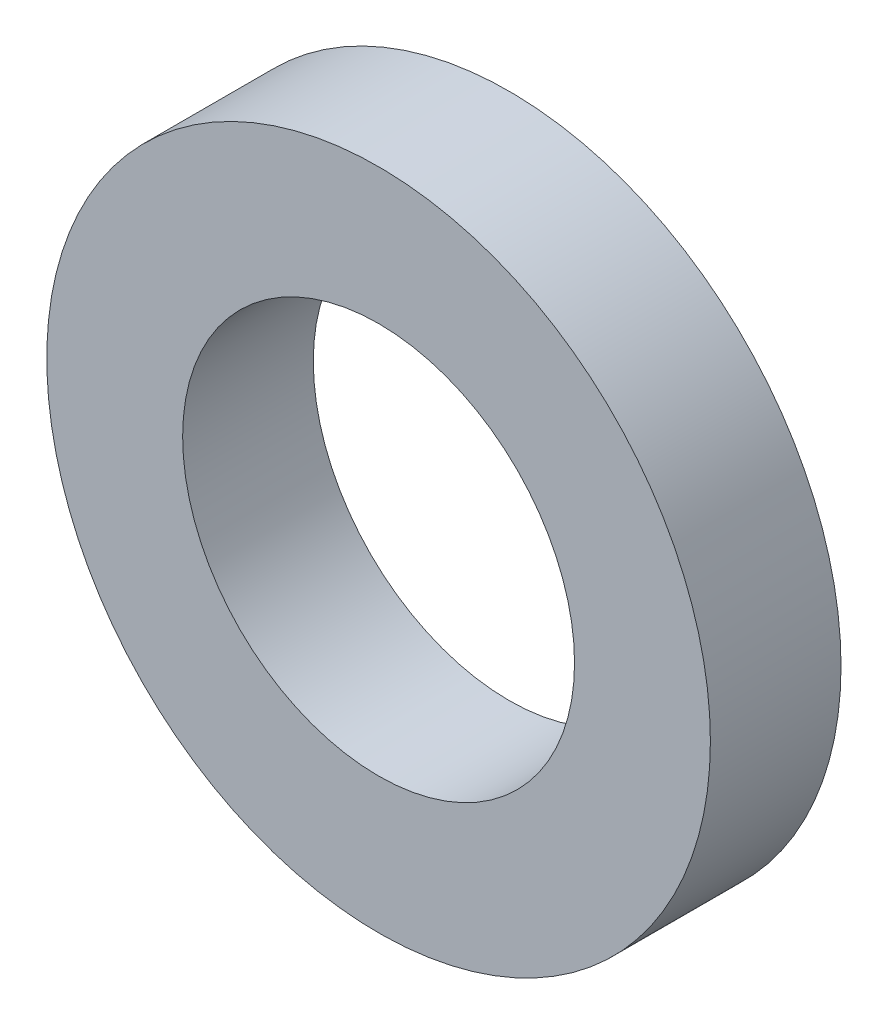
ISO-10303-21;
HEADER;
FILE_DESCRIPTION(('STEP AP214'),'2;1');
FILE_NAME('part.step','',(''),(''),'','','');
FILE_SCHEMA(('AUTOMOTIVE_DESIGN { 1 0 10303 214 1 1 1 1 }'));
ENDSEC;
DATA;
#1=APPLICATION_CONTEXT('core data for automotive mechanical design processes');
#2=APPLICATION_PROTOCOL_DEFINITION('international standard','automotive_design',2000,#1);
#3=PRODUCT_CONTEXT('',#1,'mechanical');
#4=PRODUCT('Part','Part','',(#3));
#5=PRODUCT_RELATED_PRODUCT_CATEGORY('part','',(#4));
#6=PRODUCT_DEFINITION_FORMATION('','',#4);
#7=PRODUCT_DEFINITION_CONTEXT('part definition',#1,'design');
#8=PRODUCT_DEFINITION('design','',#6,#7);
#9=PRODUCT_DEFINITION_SHAPE('','',#8);
#10=(LENGTH_UNIT() NAMED_UNIT(*) SI_UNIT(.MILLI.,.METRE.));
#11=(NAMED_UNIT(*) PLANE_ANGLE_UNIT() SI_UNIT($,.RADIAN.));
#12=(NAMED_UNIT(*) SI_UNIT($,.STERADIAN.) SOLID_ANGLE_UNIT());
#13=UNCERTAINTY_MEASURE_WITH_UNIT(LENGTH_MEASURE(1.E-05),#10,'distance_accuracy_value','');
#14=(GEOMETRIC_REPRESENTATION_CONTEXT(3) GLOBAL_UNCERTAINTY_ASSIGNED_CONTEXT((#13)) GLOBAL_UNIT_ASSIGNED_CONTEXT((#10,
#11,#12)) REPRESENTATION_CONTEXT('',''));
#15=CARTESIAN_POINT('',(0.,0.,0.));
#16=DIRECTION('',(0.,0.,1.));
#17=DIRECTION('',(1.,0.,0.));
#18=AXIS2_PLACEMENT_3D('',#15,#16,#17);
#19=CARTESIAN_POINT('',(0.,0.,0.5));
#20=DIRECTION('',(0.,0.,1.));
#21=DIRECTION('',(1.,0.,0.));
#22=AXIS2_PLACEMENT_3D('',#19,#20,#21);
#23=PLANE('',#22);
#24=CARTESIAN_POINT('',(0.,0.,0.5));
#25=DIRECTION('',(0.,0.,1.));
#26=DIRECTION('',(1.,0.,0.));
#27=AXIS2_PLACEMENT_3D('',#24,#25,#26);
#28=CIRCLE('',#27,2.54);
#29=CARTESIAN_POINT('',(2.54,0.,0.5));
#30=VERTEX_POINT('',#29);
#31=EDGE_CURVE('E10',#30,#30,#28,.T.);
#32=ORIENTED_EDGE('',*,*,#31,.T.);
#33=EDGE_LOOP('',(#32));
#34=FACE_BOUND('',#33,.T.);
#35=CARTESIAN_POINT('',(0.,0.,0.5));
#36=DIRECTION('',(0.,0.,1.));
#37=DIRECTION('',(1.,0.,0.));
#38=AXIS2_PLACEMENT_3D('',#35,#36,#37);
#39=CIRCLE('',#38,1.5);
#40=CARTESIAN_POINT('',(1.5,0.,0.5));
#41=VERTEX_POINT('',#40);
#42=EDGE_CURVE('E43',#41,#41,#39,.T.);
#43=ORIENTED_EDGE('',*,*,#42,.F.);
#44=EDGE_LOOP('',(#43));
#45=FACE_BOUND('',#44,.T.);
#46=ADVANCED_FACE('F32',(#34,#45),#23,.T.);
#47=CARTESIAN_POINT('',(0.,0.,-0.5));
#48=DIRECTION('',(0.,0.,1.));
#49=DIRECTION('',(1.,0.,0.));
#50=AXIS2_PLACEMENT_3D('',#47,#48,#49);
#51=PLANE('',#50);
#52=CARTESIAN_POINT('',(0.,0.,-0.5));
#53=DIRECTION('',(0.,0.,1.));
#54=DIRECTION('',(1.,0.,0.));
#55=AXIS2_PLACEMENT_3D('',#52,#53,#54);
#56=CIRCLE('',#55,2.54);
#57=CARTESIAN_POINT('',(2.54,0.,-0.5));
#58=VERTEX_POINT('',#57);
#59=EDGE_CURVE('E36',#58,#58,#56,.T.);
#60=ORIENTED_EDGE('',*,*,#59,.F.);
#61=EDGE_LOOP('',(#60));
#62=FACE_BOUND('',#61,.T.);
#63=CARTESIAN_POINT('',(0.,0.,-0.5));
#64=DIRECTION('',(0.,0.,1.));
#65=DIRECTION('',(1.,0.,0.));
#66=AXIS2_PLACEMENT_3D('',#63,#64,#65);
#67=CIRCLE('',#66,1.5);
#68=CARTESIAN_POINT('',(1.5,0.,-0.5));
#69=VERTEX_POINT('',#68);
#70=EDGE_CURVE('E45',#69,#69,#67,.T.);
#71=ORIENTED_EDGE('',*,*,#70,.T.);
#72=EDGE_LOOP('',(#71));
#73=FACE_BOUND('',#72,.T.);
#74=ADVANCED_FACE('F55',(#62,#73),#51,.F.);
#75=CARTESIAN_POINT('',(0.,0.,0.5));
#76=DIRECTION('',(0.,0.,-1.));
#77=DIRECTION('',(-1.,0.,0.));
#78=AXIS2_PLACEMENT_3D('',#75,#76,#77);
#79=CYLINDRICAL_SURFACE('',#78,2.54);
#80=ORIENTED_EDGE('',*,*,#31,.F.);
#81=EDGE_LOOP('',(#80));
#82=FACE_BOUND('',#81,.T.);
#83=ORIENTED_EDGE('',*,*,#59,.T.);
#84=EDGE_LOOP('',(#83));
#85=FACE_BOUND('',#84,.T.);
#86=ADVANCED_FACE('F34',(#82,#85),#79,.T.);
#87=CARTESIAN_POINT('',(0.,0.,0.5));
#88=DIRECTION('',(0.,0.,-1.));
#89=DIRECTION('',(-1.,0.,0.));
#90=AXIS2_PLACEMENT_3D('',#87,#88,#89);
#91=CYLINDRICAL_SURFACE('',#90,1.5);
#92=ORIENTED_EDGE('',*,*,#42,.T.);
#93=EDGE_LOOP('',(#92));
#94=FACE_BOUND('',#93,.T.);
#95=ORIENTED_EDGE('',*,*,#70,.F.);
#96=EDGE_LOOP('',(#95));
#97=FACE_BOUND('',#96,.T.);
#98=ADVANCED_FACE('F51',(#94,#97),#91,.F.);
#99=CLOSED_SHELL('',(#46,#74,#86,#98));
#100=MANIFOLD_SOLID_BREP('B2',#99);
#101=ADVANCED_BREP_SHAPE_REPRESENTATION('',(#18,#100),#14);
#102=SHAPE_DEFINITION_REPRESENTATION(#9,#101);
ENDSEC;
END-ISO-10303-21;
